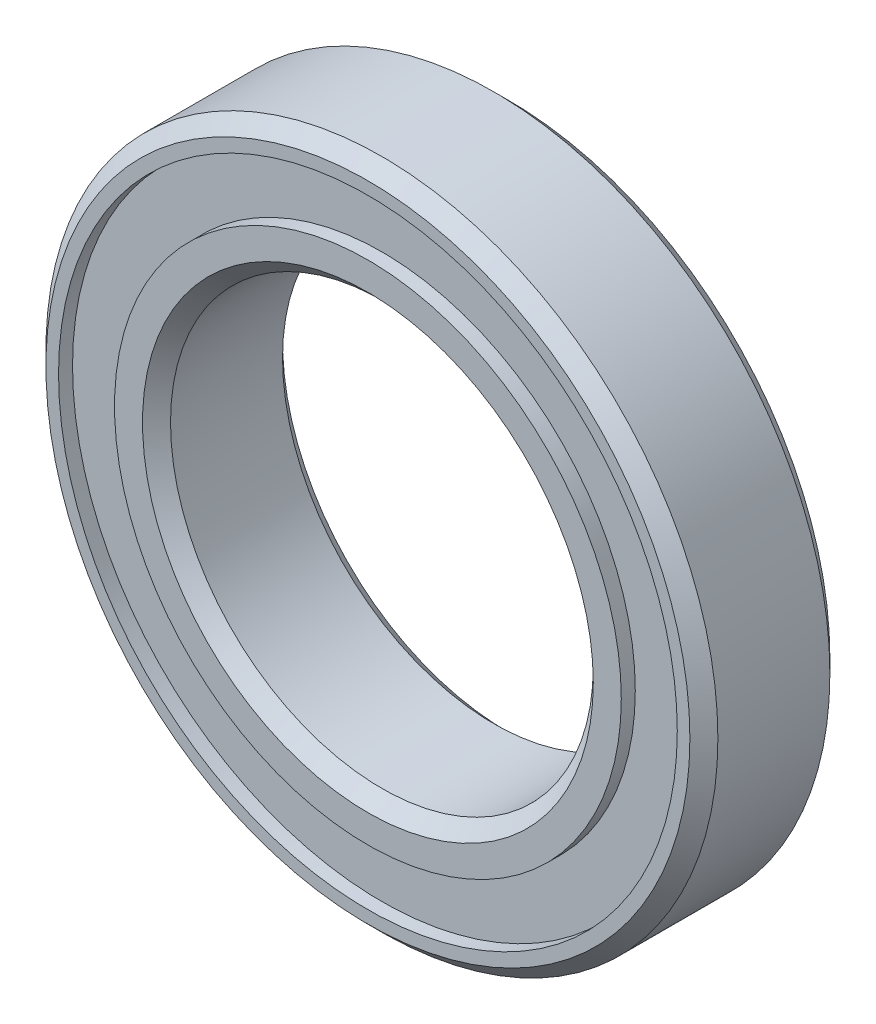
ISO-10303-21;
HEADER;
FILE_DESCRIPTION(('STEP AP214'),'2;1');
FILE_NAME('part.step','',(''),(''),'','','');
FILE_SCHEMA(('AUTOMOTIVE_DESIGN { 1 0 10303 214 1 1 1 1 }'));
ENDSEC;
DATA;
#1=APPLICATION_CONTEXT('core data for automotive mechanical design processes');
#2=APPLICATION_PROTOCOL_DEFINITION('international standard','automotive_design',2000,#1);
#3=PRODUCT_CONTEXT('',#1,'mechanical');
#4=PRODUCT('Part','Part','',(#3));
#5=PRODUCT_RELATED_PRODUCT_CATEGORY('part','',(#4));
#6=PRODUCT_DEFINITION_FORMATION('','',#4);
#7=PRODUCT_DEFINITION_CONTEXT('part definition',#1,'design');
#8=PRODUCT_DEFINITION('design','',#6,#7);
#9=PRODUCT_DEFINITION_SHAPE('','',#8);
#10=(LENGTH_UNIT() NAMED_UNIT(*) SI_UNIT(.MILLI.,.METRE.));
#11=(NAMED_UNIT(*) PLANE_ANGLE_UNIT() SI_UNIT($,.RADIAN.));
#12=(NAMED_UNIT(*) SI_UNIT($,.STERADIAN.) SOLID_ANGLE_UNIT());
#13=UNCERTAINTY_MEASURE_WITH_UNIT(LENGTH_MEASURE(1.E-05),#10,'distance_accuracy_value','');
#14=(GEOMETRIC_REPRESENTATION_CONTEXT(3) GLOBAL_UNCERTAINTY_ASSIGNED_CONTEXT((#13)) GLOBAL_UNIT_ASSIGNED_CONTEXT((#10,
#11,#12)) REPRESENTATION_CONTEXT('',''));
#15=CARTESIAN_POINT('',(0.,0.,0.));
#16=DIRECTION('',(0.,0.,1.));
#17=DIRECTION('',(1.,0.,0.));
#18=AXIS2_PLACEMENT_3D('',#15,#16,#17);
#19=CARTESIAN_POINT('',(0.,0.,0.));
#20=DIRECTION('',(0.,0.,1.));
#21=DIRECTION('',(1.,0.,0.));
#22=AXIS2_PLACEMENT_3D('',#19,#20,#21);
#23=PLANE('',#22);
#24=CARTESIAN_POINT('',(0.,0.,0.));
#25=DIRECTION('',(0.,0.,1.));
#26=DIRECTION('',(1.,0.,0.));
#27=AXIS2_PLACEMENT_3D('',#24,#25,#26);
#28=CIRCLE('',#27,8.05);
#29=CARTESIAN_POINT('',(8.05,0.,0.));
#30=VERTEX_POINT('',#29);
#31=EDGE_CURVE('E55',#30,#30,#28,.T.);
#32=ORIENTED_EDGE('',*,*,#31,.T.);
#33=EDGE_LOOP('',(#32));
#34=FACE_BOUND('',#33,.T.);
#35=CARTESIAN_POINT('',(0.,0.,0.));
#36=DIRECTION('',(0.,0.,-1.));
#37=DIRECTION('',(-1.,0.,0.));
#38=AXIS2_PLACEMENT_3D('',#35,#36,#37);
#39=CIRCLE('',#38,9.05);
#40=CARTESIAN_POINT('',(-9.05,0.,0.));
#41=VERTEX_POINT('',#40);
#42=EDGE_CURVE('E86',#41,#41,#39,.T.);
#43=ORIENTED_EDGE('',*,*,#42,.T.);
#44=EDGE_LOOP('',(#43));
#45=FACE_BOUND('',#44,.T.);
#46=ADVANCED_FACE('F34',(#34,#45),#23,.F.);
#47=CARTESIAN_POINT('',(0.,0.,5.));
#48=DIRECTION('',(0.,0.,1.));
#49=DIRECTION('',(1.,0.,0.));
#50=AXIS2_PLACEMENT_3D('',#47,#48,#49);
#51=PLANE('',#50);
#52=CARTESIAN_POINT('',(0.,0.,5.));
#53=DIRECTION('',(0.,0.,1.));
#54=DIRECTION('',(1.,0.,0.));
#55=AXIS2_PLACEMENT_3D('',#52,#53,#54);
#56=CIRCLE('',#55,8.05);
#57=CARTESIAN_POINT('',(8.05,0.,5.));
#58=VERTEX_POINT('',#57);
#59=EDGE_CURVE('E58',#58,#58,#56,.F.);
#60=ORIENTED_EDGE('',*,*,#59,.T.);
#61=EDGE_LOOP('',(#60));
#62=FACE_BOUND('',#61,.T.);
#63=CARTESIAN_POINT('',(0.,0.,5.));
#64=DIRECTION('',(0.,0.,1.));
#65=DIRECTION('',(1.,0.,0.));
#66=AXIS2_PLACEMENT_3D('',#63,#64,#65);
#67=CIRCLE('',#66,9.05);
#68=CARTESIAN_POINT('',(9.05,0.,5.));
#69=VERTEX_POINT('',#68);
#70=EDGE_CURVE('E74',#69,#69,#67,.T.);
#71=ORIENTED_EDGE('',*,*,#70,.T.);
#72=EDGE_LOOP('',(#71));
#73=FACE_BOUND('',#72,.T.);
#74=ADVANCED_FACE('F119',(#62,#73),#51,.T.);
#75=CARTESIAN_POINT('',(0.,0.,5.));
#76=DIRECTION('',(0.,0.,1.));
#77=DIRECTION('',(1.,0.,0.));
#78=AXIS2_PLACEMENT_3D('',#75,#76,#77);
#79=CIRCLE('',#78,11.5);
#80=CARTESIAN_POINT('',(11.5,0.,5.));
#81=VERTEX_POINT('',#80);
#82=EDGE_CURVE('E50',#81,#81,#79,.T.);
#83=ORIENTED_EDGE('',*,*,#82,.T.);
#84=EDGE_LOOP('',(#83));
#85=FACE_BOUND('',#84,.T.);
#86=CARTESIAN_POINT('',(0.,0.,5.));
#87=DIRECTION('',(0.,0.,1.));
#88=DIRECTION('',(1.,0.,0.));
#89=AXIS2_PLACEMENT_3D('',#86,#87,#88);
#90=CIRCLE('',#89,11.05);
#91=CARTESIAN_POINT('',(11.05,0.,5.));
#92=VERTEX_POINT('',#91);
#93=EDGE_CURVE('E68',#92,#92,#90,.T.);
#94=ORIENTED_EDGE('',*,*,#93,.F.);
#95=EDGE_LOOP('',(#94));
#96=FACE_BOUND('',#95,.T.);
#97=ADVANCED_FACE('F111',(#85,#96),#51,.T.);
#98=CARTESIAN_POINT('',(0.,0.,0.));
#99=DIRECTION('',(0.,0.,1.));
#100=DIRECTION('',(1.,0.,0.));
#101=AXIS2_PLACEMENT_3D('',#98,#99,#100);
#102=CIRCLE('',#101,11.5);
#103=CARTESIAN_POINT('',(11.5,0.,0.));
#104=VERTEX_POINT('',#103);
#105=EDGE_CURVE('E10',#104,#104,#102,.F.);
#106=ORIENTED_EDGE('',*,*,#105,.T.);
#107=EDGE_LOOP('',(#106));
#108=FACE_BOUND('',#107,.T.);
#109=CARTESIAN_POINT('',(0.,0.,0.));
#110=DIRECTION('',(0.,0.,-1.));
#111=DIRECTION('',(-1.,0.,0.));
#112=AXIS2_PLACEMENT_3D('',#109,#110,#111);
#113=CIRCLE('',#112,11.05);
#114=CARTESIAN_POINT('',(-11.05,0.,0.));
#115=VERTEX_POINT('',#114);
#116=EDGE_CURVE('E80',#115,#115,#113,.T.);
#117=ORIENTED_EDGE('',*,*,#116,.F.);
#118=EDGE_LOOP('',(#117));
#119=FACE_BOUND('',#118,.T.);
#120=ADVANCED_FACE('F108',(#108,#119),#23,.F.);
#121=CARTESIAN_POINT('',(0.,0.,5.));
#122=DIRECTION('',(0.,0.,-1.));
#123=DIRECTION('',(-1.,0.,0.));
#124=AXIS2_PLACEMENT_3D('',#121,#122,#123);
#125=CYLINDRICAL_SURFACE('',#124,12.);
#126=CARTESIAN_POINT('',(0.,0.,4.5));
#127=DIRECTION('',(0.,0.,1.));
#128=DIRECTION('',(1.,0.,0.));
#129=AXIS2_PLACEMENT_3D('',#126,#127,#128);
#130=CIRCLE('',#129,12.);
#131=CARTESIAN_POINT('',(12.,0.,4.5));
#132=VERTEX_POINT('',#131);
#133=EDGE_CURVE('E42',#132,#132,#130,.F.);
#134=ORIENTED_EDGE('',*,*,#133,.T.);
#135=EDGE_LOOP('',(#134));
#136=FACE_BOUND('',#135,.T.);
#137=CARTESIAN_POINT('',(0.,0.,0.499999999999999));
#138=DIRECTION('',(0.,0.,1.));
#139=DIRECTION('',(1.,0.,0.));
#140=AXIS2_PLACEMENT_3D('',#137,#138,#139);
#141=CIRCLE('',#140,12.);
#142=CARTESIAN_POINT('',(12.,0.,0.499999999999999));
#143=VERTEX_POINT('',#142);
#144=EDGE_CURVE('E46',#143,#143,#141,.T.);
#145=ORIENTED_EDGE('',*,*,#144,.T.);
#146=EDGE_LOOP('',(#145));
#147=FACE_BOUND('',#146,.T.);
#148=ADVANCED_FACE('F110',(#136,#147),#125,.T.);
#149=CARTESIAN_POINT('',(0.,0.,5.));
#150=DIRECTION('',(0.,0.,-1.));
#151=DIRECTION('',(-1.,0.,0.));
#152=AXIS2_PLACEMENT_3D('',#149,#150,#151);
#153=CYLINDRICAL_SURFACE('',#152,7.55);
#154=CARTESIAN_POINT('',(0.,0.,4.5));
#155=DIRECTION('',(0.,0.,1.));
#156=DIRECTION('',(1.,0.,0.));
#157=AXIS2_PLACEMENT_3D('',#154,#155,#156);
#158=CIRCLE('',#157,7.55);
#159=CARTESIAN_POINT('',(7.55,0.,4.5));
#160=VERTEX_POINT('',#159);
#161=EDGE_CURVE('E61',#160,#160,#158,.T.);
#162=ORIENTED_EDGE('',*,*,#161,.T.);
#163=EDGE_LOOP('',(#162));
#164=FACE_BOUND('',#163,.T.);
#165=CARTESIAN_POINT('',(0.,0.,0.500000000000004));
#166=DIRECTION('',(0.,0.,1.));
#167=DIRECTION('',(1.,0.,0.));
#168=AXIS2_PLACEMENT_3D('',#165,#166,#167);
#169=CIRCLE('',#168,7.55);
#170=CARTESIAN_POINT('',(7.55,0.,0.500000000000004));
#171=VERTEX_POINT('',#170);
#172=EDGE_CURVE('E64',#171,#171,#169,.F.);
#173=ORIENTED_EDGE('',*,*,#172,.T.);
#174=EDGE_LOOP('',(#173));
#175=FACE_BOUND('',#174,.T.);
#176=ADVANCED_FACE('F117',(#164,#175),#153,.F.);
#177=CARTESIAN_POINT('',(0.,0.,4.5));
#178=DIRECTION('',(0.,0.,1.));
#179=DIRECTION('',(1.,0.,0.));
#180=AXIS2_PLACEMENT_3D('',#177,#178,#179);
#181=CYLINDRICAL_SURFACE('',#180,11.05);
#182=CARTESIAN_POINT('',(0.,0.,4.5));
#183=DIRECTION('',(0.,0.,1.));
#184=DIRECTION('',(1.,0.,0.));
#185=AXIS2_PLACEMENT_3D('',#182,#183,#184);
#186=CIRCLE('',#185,11.05);
#187=CARTESIAN_POINT('',(11.05,0.,4.5));
#188=VERTEX_POINT('',#187);
#189=EDGE_CURVE('E67',#188,#188,#186,.T.);
#190=ORIENTED_EDGE('',*,*,#189,.F.);
#191=EDGE_LOOP('',(#190));
#192=FACE_BOUND('',#191,.T.);
#193=ORIENTED_EDGE('',*,*,#93,.T.);
#194=EDGE_LOOP('',(#193));
#195=FACE_BOUND('',#194,.T.);
#196=ADVANCED_FACE('F147',(#192,#195),#181,.F.);
#197=CARTESIAN_POINT('',(0.,0.,4.5));
#198=DIRECTION('',(0.,0.,1.));
#199=DIRECTION('',(1.,0.,0.));
#200=AXIS2_PLACEMENT_3D('',#197,#198,#199);
#201=PLANE('',#200);
#202=CARTESIAN_POINT('',(0.,0.,4.5));
#203=DIRECTION('',(0.,0.,1.));
#204=DIRECTION('',(1.,0.,0.));
#205=AXIS2_PLACEMENT_3D('',#202,#203,#204);
#206=CIRCLE('',#205,9.05);
#207=CARTESIAN_POINT('',(9.05,0.,4.5));
#208=VERTEX_POINT('',#207);
#209=EDGE_CURVE('E71',#208,#208,#206,.T.);
#210=ORIENTED_EDGE('',*,*,#209,.F.);
#211=EDGE_LOOP('',(#210));
#212=FACE_BOUND('',#211,.T.);
#213=ORIENTED_EDGE('',*,*,#189,.T.);
#214=EDGE_LOOP('',(#213));
#215=FACE_BOUND('',#214,.T.);
#216=ADVANCED_FACE('F143',(#212,#215),#201,.T.);
#217=CARTESIAN_POINT('',(0.,0.,4.5));
#218=DIRECTION('',(0.,0.,1.));
#219=DIRECTION('',(1.,0.,0.));
#220=AXIS2_PLACEMENT_3D('',#217,#218,#219);
#221=CYLINDRICAL_SURFACE('',#220,9.05);
#222=ORIENTED_EDGE('',*,*,#209,.T.);
#223=EDGE_LOOP('',(#222));
#224=FACE_BOUND('',#223,.T.);
#225=ORIENTED_EDGE('',*,*,#70,.F.);
#226=EDGE_LOOP('',(#225));
#227=FACE_BOUND('',#226,.T.);
#228=ADVANCED_FACE('F104',(#224,#227),#221,.T.);
#229=CARTESIAN_POINT('',(0.,0.,0.5));
#230=DIRECTION('',(0.,0.,-1.));
#231=DIRECTION('',(-1.,0.,0.));
#232=AXIS2_PLACEMENT_3D('',#229,#230,#231);
#233=CYLINDRICAL_SURFACE('',#232,11.05);
#234=CARTESIAN_POINT('',(0.,0.,0.5));
#235=DIRECTION('',(0.,0.,-1.));
#236=DIRECTION('',(-1.,0.,0.));
#237=AXIS2_PLACEMENT_3D('',#234,#235,#236);
#238=CIRCLE('',#237,11.05);
#239=CARTESIAN_POINT('',(-11.05,0.,0.5));
#240=VERTEX_POINT('',#239);
#241=EDGE_CURVE('E77',#240,#240,#238,.T.);
#242=ORIENTED_EDGE('',*,*,#241,.F.);
#243=EDGE_LOOP('',(#242));
#244=FACE_BOUND('',#243,.T.);
#245=ORIENTED_EDGE('',*,*,#116,.T.);
#246=EDGE_LOOP('',(#245));
#247=FACE_BOUND('',#246,.T.);
#248=ADVANCED_FACE('F98',(#244,#247),#233,.F.);
#249=CARTESIAN_POINT('',(0.,0.,0.5));
#250=DIRECTION('',(0.,0.,-1.));
#251=DIRECTION('',(-1.,0.,0.));
#252=AXIS2_PLACEMENT_3D('',#249,#250,#251);
#253=PLANE('',#252);
#254=CARTESIAN_POINT('',(0.,0.,0.5));
#255=DIRECTION('',(0.,0.,-1.));
#256=DIRECTION('',(-1.,0.,0.));
#257=AXIS2_PLACEMENT_3D('',#254,#255,#256);
#258=CIRCLE('',#257,9.05);
#259=CARTESIAN_POINT('',(-9.05,0.,0.5));
#260=VERTEX_POINT('',#259);
#261=EDGE_CURVE('E83',#260,#260,#258,.T.);
#262=ORIENTED_EDGE('',*,*,#261,.F.);
#263=EDGE_LOOP('',(#262));
#264=FACE_BOUND('',#263,.T.);
#265=ORIENTED_EDGE('',*,*,#241,.T.);
#266=EDGE_LOOP('',(#265));
#267=FACE_BOUND('',#266,.T.);
#268=ADVANCED_FACE('F95',(#264,#267),#253,.T.);
#269=CARTESIAN_POINT('',(0.,0.,0.5));
#270=DIRECTION('',(0.,0.,-1.));
#271=DIRECTION('',(-1.,0.,0.));
#272=AXIS2_PLACEMENT_3D('',#269,#270,#271);
#273=CYLINDRICAL_SURFACE('',#272,9.05);
#274=ORIENTED_EDGE('',*,*,#261,.T.);
#275=EDGE_LOOP('',(#274));
#276=FACE_BOUND('',#275,.T.);
#277=ORIENTED_EDGE('',*,*,#42,.F.);
#278=EDGE_LOOP('',(#277));
#279=FACE_BOUND('',#278,.T.);
#280=ADVANCED_FACE('F92',(#276,#279),#273,.T.);
#281=CARTESIAN_POINT('',(0.,0.,4.5));
#282=DIRECTION('',(0.,0.,1.));
#283=DIRECTION('',(1.,0.,0.));
#284=AXIS2_PLACEMENT_3D('',#281,#282,#283);
#285=CONICAL_SURFACE('',#284,7.55,0.785398163397447);
#286=ORIENTED_EDGE('',*,*,#59,.F.);
#287=EDGE_LOOP('',(#286));
#288=FACE_BOUND('',#287,.T.);
#289=ORIENTED_EDGE('',*,*,#161,.F.);
#290=EDGE_LOOP('',(#289));
#291=FACE_BOUND('',#290,.T.);
#292=ADVANCED_FACE('F132',(#288,#291),#285,.F.);
#293=CARTESIAN_POINT('',(0.,0.,0.));
#294=DIRECTION('',(0.,0.,-1.));
#295=DIRECTION('',(-1.,0.,0.));
#296=AXIS2_PLACEMENT_3D('',#293,#294,#295);
#297=CONICAL_SURFACE('',#296,8.05,0.785398163397443);
#298=ORIENTED_EDGE('',*,*,#172,.F.);
#299=EDGE_LOOP('',(#298));
#300=FACE_BOUND('',#299,.T.);
#301=ORIENTED_EDGE('',*,*,#31,.F.);
#302=EDGE_LOOP('',(#301));
#303=FACE_BOUND('',#302,.T.);
#304=ADVANCED_FACE('F137',(#300,#303),#297,.F.);
#305=CARTESIAN_POINT('',(0.,0.,5.));
#306=DIRECTION('',(0.,0.,-1.));
#307=DIRECTION('',(-1.,0.,0.));
#308=AXIS2_PLACEMENT_3D('',#305,#306,#307);
#309=CONICAL_SURFACE('',#308,11.5,0.785398163397447);
#310=ORIENTED_EDGE('',*,*,#133,.F.);
#311=EDGE_LOOP('',(#310));
#312=FACE_BOUND('',#311,.T.);
#313=ORIENTED_EDGE('',*,*,#82,.F.);
#314=EDGE_LOOP('',(#313));
#315=FACE_BOUND('',#314,.T.);
#316=ADVANCED_FACE('F162',(#312,#315),#309,.T.);
#317=CARTESIAN_POINT('',(0.,0.,0.499999999999999));
#318=DIRECTION('',(0.,0.,1.));
#319=DIRECTION('',(1.,0.,0.));
#320=AXIS2_PLACEMENT_3D('',#317,#318,#319);
#321=CONICAL_SURFACE('',#320,12.,0.78539816339745);
#322=ORIENTED_EDGE('',*,*,#105,.F.);
#323=EDGE_LOOP('',(#322));
#324=FACE_BOUND('',#323,.T.);
#325=ORIENTED_EDGE('',*,*,#144,.F.);
#326=EDGE_LOOP('',(#325));
#327=FACE_BOUND('',#326,.T.);
#328=ADVANCED_FACE('F37',(#324,#327),#321,.T.);
#329=CLOSED_SHELL('',(#46,#74,#97,#120,#148,#176,#196,#216,#228,#248,#268,#280,#292,#304,#316,#328));
#330=MANIFOLD_SOLID_BREP('B2',#329);
#331=ADVANCED_BREP_SHAPE_REPRESENTATION('',(#18,#330),#14);
#332=SHAPE_DEFINITION_REPRESENTATION(#9,#331);
ENDSEC;
END-ISO-10303-21;
